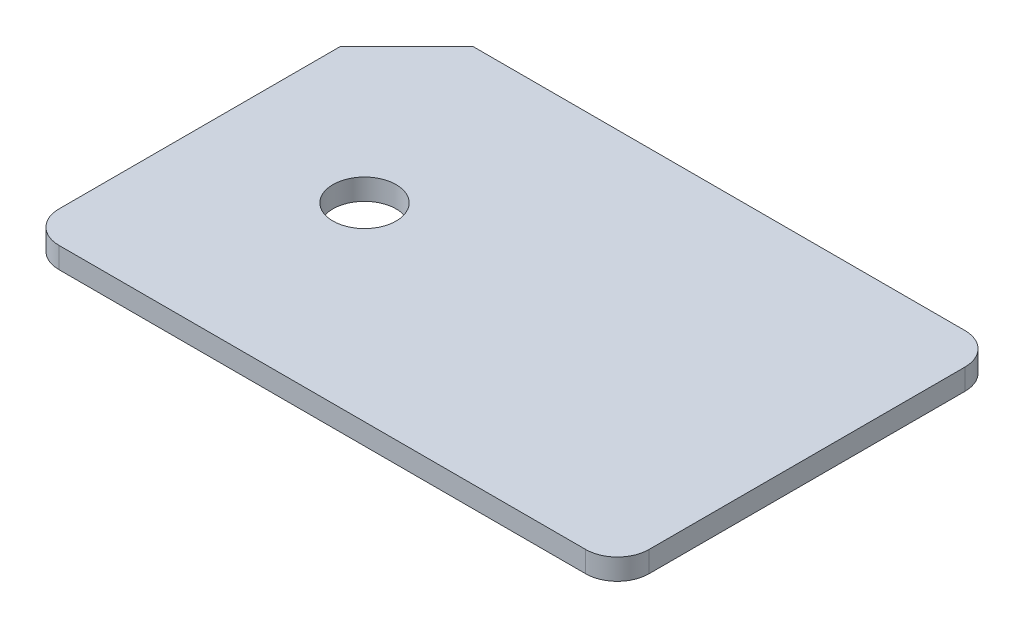
ISO-10303-21;
HEADER;
FILE_DESCRIPTION(('STEP AP214'),'2;1');
FILE_NAME('part.step','',(''),(''),'','','');
FILE_SCHEMA(('AUTOMOTIVE_DESIGN { 1 0 10303 214 1 1 1 1 }'));
ENDSEC;
DATA;
#1=APPLICATION_CONTEXT('core data for automotive mechanical design processes');
#2=APPLICATION_PROTOCOL_DEFINITION('international standard','automotive_design',2000,#1);
#3=PRODUCT_CONTEXT('',#1,'mechanical');
#4=PRODUCT('Part','Part','',(#3));
#5=PRODUCT_RELATED_PRODUCT_CATEGORY('part','',(#4));
#6=PRODUCT_DEFINITION_FORMATION('','',#4);
#7=PRODUCT_DEFINITION_CONTEXT('part definition',#1,'design');
#8=PRODUCT_DEFINITION('design','',#6,#7);
#9=PRODUCT_DEFINITION_SHAPE('','',#8);
#10=(LENGTH_UNIT() NAMED_UNIT(*) SI_UNIT(.MILLI.,.METRE.));
#11=(NAMED_UNIT(*) PLANE_ANGLE_UNIT() SI_UNIT($,.RADIAN.));
#12=(NAMED_UNIT(*) SI_UNIT($,.STERADIAN.) SOLID_ANGLE_UNIT());
#13=UNCERTAINTY_MEASURE_WITH_UNIT(LENGTH_MEASURE(1.E-05),#10,'distance_accuracy_value','');
#14=(GEOMETRIC_REPRESENTATION_CONTEXT(3) GLOBAL_UNCERTAINTY_ASSIGNED_CONTEXT((#13)) GLOBAL_UNIT_ASSIGNED_CONTEXT((#10,
#11,#12)) REPRESENTATION_CONTEXT('',''));
#15=CARTESIAN_POINT('',(0.,0.,0.));
#16=DIRECTION('',(0.,0.,1.));
#17=DIRECTION('',(1.,0.,0.));
#18=AXIS2_PLACEMENT_3D('',#15,#16,#17);
#19=CARTESIAN_POINT('',(-56.6627466075891,2.,-2.88460635432216));
#20=DIRECTION('',(1.,0.,0.));
#21=DIRECTION('',(0.,0.,-1.));
#22=AXIS2_PLACEMENT_3D('',#19,#20,#21);
#23=PLANE('',#22);
#24=DIRECTION('',(0.,0.,1.));
#25=VECTOR('',#24,1.);
#26=CARTESIAN_POINT('',(-56.6627466075891,0.,-2.88460635432216));
#27=LINE('',#26,#25);
#28=CARTESIAN_POINT('',(-56.6627466075892,0.,-29.556179229576));
#29=VERTEX_POINT('',#28);
#30=CARTESIAN_POINT('',(-56.6627466075891,0.,-2.88460635432216));
#31=VERTEX_POINT('',#30);
#32=EDGE_CURVE('E129',#29,#31,#27,.T.);
#33=ORIENTED_EDGE('',*,*,#32,.T.);
#34=DIRECTION('',(0.,-1.,0.));
#35=VECTOR('',#34,1.);
#36=CARTESIAN_POINT('',(-56.6627466075891,2.,-2.88460635432216));
#37=LINE('',#36,#35);
#38=CARTESIAN_POINT('',(-56.6627466075891,2.,-2.88460635432216));
#39=VERTEX_POINT('',#38);
#40=EDGE_CURVE('E11',#39,#31,#37,.T.);
#41=ORIENTED_EDGE('',*,*,#40,.F.);
#42=DIRECTION('',(0.,0.,1.));
#43=VECTOR('',#42,1.);
#44=CARTESIAN_POINT('',(-56.6627466075891,2.,-2.88460635432216));
#45=LINE('',#44,#43);
#46=CARTESIAN_POINT('',(-56.6627466075892,2.,-29.556179229576));
#47=VERTEX_POINT('',#46);
#48=EDGE_CURVE('E144',#47,#39,#45,.T.);
#49=ORIENTED_EDGE('',*,*,#48,.F.);
#50=DIRECTION('',(0.,-1.,0.));
#51=VECTOR('',#50,1.);
#52=CARTESIAN_POINT('',(-56.6627466075892,2.,-29.556179229576));
#53=LINE('',#52,#51);
#54=EDGE_CURVE('E125',#47,#29,#53,.T.);
#55=ORIENTED_EDGE('',*,*,#54,.T.);
#56=EDGE_LOOP('',(#33,#41,#49,#55));
#57=FACE_BOUND('',#56,.T.);
#58=ADVANCED_FACE('F33',(#57),#23,.F.);
#59=CARTESIAN_POINT('',(-53.6627466075891,2.,-2.88460635432216));
#60=DIRECTION('',(0.,-1.,0.));
#61=DIRECTION('',(0.,0.,-1.));
#62=AXIS2_PLACEMENT_3D('',#59,#60,#61);
#63=CYLINDRICAL_SURFACE('',#62,2.99999999999999);
#64=CARTESIAN_POINT('',(-53.6627466075891,0.,-2.88460635432216));
#65=DIRECTION('',(0.,1.,0.));
#66=DIRECTION('',(0.,0.,1.));
#67=AXIS2_PLACEMENT_3D('',#64,#65,#66);
#68=CIRCLE('',#67,2.99999999999999);
#69=CARTESIAN_POINT('',(-53.6627466075891,0.,0.115393645677819));
#70=VERTEX_POINT('',#69);
#71=EDGE_CURVE('E132',#31,#70,#68,.T.);
#72=ORIENTED_EDGE('',*,*,#71,.T.);
#73=DIRECTION('',(0.,-1.,0.));
#74=VECTOR('',#73,1.);
#75=CARTESIAN_POINT('',(-53.6627466075891,2.,0.115393645677819));
#76=LINE('',#75,#74);
#77=CARTESIAN_POINT('',(-53.6627466075891,2.,0.115393645677819));
#78=VERTEX_POINT('',#77);
#79=EDGE_CURVE('E41',#78,#70,#76,.T.);
#80=ORIENTED_EDGE('',*,*,#79,.F.);
#81=CARTESIAN_POINT('',(-53.6627466075891,2.,-2.88460635432216));
#82=DIRECTION('',(0.,1.,0.));
#83=DIRECTION('',(0.,0.,1.));
#84=AXIS2_PLACEMENT_3D('',#81,#82,#83);
#85=CIRCLE('',#84,2.99999999999999);
#86=EDGE_CURVE('E92',#39,#78,#85,.T.);
#87=ORIENTED_EDGE('',*,*,#86,.F.);
#88=ORIENTED_EDGE('',*,*,#40,.T.);
#89=EDGE_LOOP('',(#72,#80,#87,#88));
#90=FACE_BOUND('',#89,.T.);
#91=ADVANCED_FACE('F200',(#90),#63,.T.);
#92=CARTESIAN_POINT('',(-3.66274660758915,2.,0.115393645677819));
#93=DIRECTION('',(0.,0.,-1.));
#94=DIRECTION('',(-1.,0.,0.));
#95=AXIS2_PLACEMENT_3D('',#92,#93,#94);
#96=PLANE('',#95);
#97=DIRECTION('',(1.,0.,0.));
#98=VECTOR('',#97,1.);
#99=CARTESIAN_POINT('',(-3.66274660758915,0.,0.115393645677819));
#100=LINE('',#99,#98);
#101=CARTESIAN_POINT('',(-3.66274660758915,0.,0.115393645677813));
#102=VERTEX_POINT('',#101);
#103=EDGE_CURVE('E135',#70,#102,#100,.T.);
#104=ORIENTED_EDGE('',*,*,#103,.T.);
#105=DIRECTION('',(0.,-1.,0.));
#106=VECTOR('',#105,1.);
#107=CARTESIAN_POINT('',(-3.66274660758915,2.,0.115393645677813));
#108=LINE('',#107,#106);
#109=CARTESIAN_POINT('',(-3.66274660758915,2.,0.115393645677813));
#110=VERTEX_POINT('',#109);
#111=EDGE_CURVE('E151',#110,#102,#108,.T.);
#112=ORIENTED_EDGE('',*,*,#111,.F.);
#113=DIRECTION('',(1.,0.,0.));
#114=VECTOR('',#113,1.);
#115=CARTESIAN_POINT('',(-3.66274660758915,2.,0.115393645677819));
#116=LINE('',#115,#114);
#117=EDGE_CURVE('E159',#78,#110,#116,.T.);
#118=ORIENTED_EDGE('',*,*,#117,.F.);
#119=ORIENTED_EDGE('',*,*,#79,.T.);
#120=EDGE_LOOP('',(#104,#112,#118,#119));
#121=FACE_BOUND('',#120,.T.);
#122=ADVANCED_FACE('F157',(#121),#96,.F.);
#123=CARTESIAN_POINT('',(-3.66274660758915,2.,-2.88460635432219));
#124=DIRECTION('',(0.,-1.,0.));
#125=DIRECTION('',(0.,0.,-1.));
#126=AXIS2_PLACEMENT_3D('',#123,#124,#125);
#127=CYLINDRICAL_SURFACE('',#126,3.);
#128=CARTESIAN_POINT('',(-3.66274660758915,0.,-2.88460635432219));
#129=DIRECTION('',(0.,1.,0.));
#130=DIRECTION('',(0.,0.,1.));
#131=AXIS2_PLACEMENT_3D('',#128,#129,#130);
#132=CIRCLE('',#131,3.);
#133=CARTESIAN_POINT('',(-0.662746607589148,0.,-2.88460635432219));
#134=VERTEX_POINT('',#133);
#135=EDGE_CURVE('E137',#102,#134,#132,.T.);
#136=ORIENTED_EDGE('',*,*,#135,.T.);
#137=DIRECTION('',(0.,-1.,0.));
#138=VECTOR('',#137,1.);
#139=CARTESIAN_POINT('',(-0.662746607589148,2.,-2.88460635432219));
#140=LINE('',#139,#138);
#141=CARTESIAN_POINT('',(-0.662746607589148,2.,-2.88460635432219));
#142=VERTEX_POINT('',#141);
#143=EDGE_CURVE('E148',#142,#134,#140,.T.);
#144=ORIENTED_EDGE('',*,*,#143,.F.);
#145=CARTESIAN_POINT('',(-3.66274660758915,2.,-2.88460635432219));
#146=DIRECTION('',(0.,1.,0.));
#147=DIRECTION('',(0.,0.,1.));
#148=AXIS2_PLACEMENT_3D('',#145,#146,#147);
#149=CIRCLE('',#148,3.);
#150=EDGE_CURVE('E171',#110,#142,#149,.T.);
#151=ORIENTED_EDGE('',*,*,#150,.F.);
#152=ORIENTED_EDGE('',*,*,#111,.T.);
#153=EDGE_LOOP('',(#136,#144,#151,#152));
#154=FACE_BOUND('',#153,.T.);
#155=ADVANCED_FACE('F167',(#154),#127,.T.);
#156=CARTESIAN_POINT('',(-0.662746607589252,2.,-32.8846063543222));
#157=DIRECTION('',(-1.,0.,0.));
#158=DIRECTION('',(0.,0.,1.));
#159=AXIS2_PLACEMENT_3D('',#156,#157,#158);
#160=PLANE('',#159);
#161=DIRECTION('',(0.,0.,-1.));
#162=VECTOR('',#161,1.);
#163=CARTESIAN_POINT('',(-0.662746607589252,0.,-32.8846063543222));
#164=LINE('',#163,#162);
#165=CARTESIAN_POINT('',(-0.662746607589254,0.,-32.8846063543222));
#166=VERTEX_POINT('',#165);
#167=EDGE_CURVE('E139',#134,#166,#164,.T.);
#168=ORIENTED_EDGE('',*,*,#167,.T.);
#169=DIRECTION('',(0.,-1.,0.));
#170=VECTOR('',#169,1.);
#171=CARTESIAN_POINT('',(-0.662746607589254,2.,-32.8846063543222));
#172=LINE('',#171,#170);
#173=CARTESIAN_POINT('',(-0.662746607589254,2.,-32.8846063543222));
#174=VERTEX_POINT('',#173);
#175=EDGE_CURVE('E120',#174,#166,#172,.T.);
#176=ORIENTED_EDGE('',*,*,#175,.F.);
#177=DIRECTION('',(0.,0.,-1.));
#178=VECTOR('',#177,1.);
#179=CARTESIAN_POINT('',(-0.662746607589252,2.,-32.8846063543222));
#180=LINE('',#179,#178);
#181=EDGE_CURVE('E111',#142,#174,#180,.T.);
#182=ORIENTED_EDGE('',*,*,#181,.F.);
#183=ORIENTED_EDGE('',*,*,#143,.T.);
#184=EDGE_LOOP('',(#168,#176,#182,#183));
#185=FACE_BOUND('',#184,.T.);
#186=ADVANCED_FACE('F170',(#185),#160,.F.);
#187=CARTESIAN_POINT('',(-3.66274660758926,2.,-32.8846063543222));
#188=DIRECTION('',(0.,-1.,0.));
#189=DIRECTION('',(0.,0.,-1.));
#190=AXIS2_PLACEMENT_3D('',#187,#188,#189);
#191=CYLINDRICAL_SURFACE('',#190,3.);
#192=CARTESIAN_POINT('',(-3.66274660758926,0.,-32.8846063543222));
#193=DIRECTION('',(0.,1.,0.));
#194=DIRECTION('',(0.,0.,1.));
#195=AXIS2_PLACEMENT_3D('',#192,#193,#194);
#196=CIRCLE('',#195,3.);
#197=CARTESIAN_POINT('',(-3.66274660758926,0.,-35.8846063543222));
#198=VERTEX_POINT('',#197);
#199=EDGE_CURVE('E119',#166,#198,#196,.T.);
#200=ORIENTED_EDGE('',*,*,#199,.T.);
#201=DIRECTION('',(0.,-1.,0.));
#202=VECTOR('',#201,1.);
#203=CARTESIAN_POINT('',(-3.66274660758926,2.,-35.8846063543222));
#204=LINE('',#203,#202);
#205=CARTESIAN_POINT('',(-3.66274660758926,2.,-35.8846063543222));
#206=VERTEX_POINT('',#205);
#207=EDGE_CURVE('E116',#206,#198,#204,.T.);
#208=ORIENTED_EDGE('',*,*,#207,.F.);
#209=CARTESIAN_POINT('',(-3.66274660758926,2.,-32.8846063543222));
#210=DIRECTION('',(0.,1.,0.));
#211=DIRECTION('',(0.,0.,1.));
#212=AXIS2_PLACEMENT_3D('',#209,#210,#211);
#213=CIRCLE('',#212,3.);
#214=EDGE_CURVE('E105',#174,#206,#213,.T.);
#215=ORIENTED_EDGE('',*,*,#214,.F.);
#216=ORIENTED_EDGE('',*,*,#175,.T.);
#217=EDGE_LOOP('',(#200,#208,#215,#216));
#218=FACE_BOUND('',#217,.T.);
#219=ADVANCED_FACE('F117',(#218),#191,.T.);
#220=CARTESIAN_POINT('',(-50.3343194828431,2.,-35.8846063543222));
#221=DIRECTION('',(0.,0.,1.));
#222=DIRECTION('',(1.,0.,0.));
#223=AXIS2_PLACEMENT_3D('',#220,#221,#222);
#224=PLANE('',#223);
#225=DIRECTION('',(-1.,0.,0.));
#226=VECTOR('',#225,1.);
#227=CARTESIAN_POINT('',(-50.3343194828431,0.,-35.8846063543222));
#228=LINE('',#227,#226);
#229=CARTESIAN_POINT('',(-50.3343194828431,0.,-35.8846063543222));
#230=VERTEX_POINT('',#229);
#231=EDGE_CURVE('E78',#198,#230,#228,.T.);
#232=ORIENTED_EDGE('',*,*,#231,.T.);
#233=DIRECTION('',(0.,-1.,0.));
#234=VECTOR('',#233,1.);
#235=CARTESIAN_POINT('',(-50.3343194828431,2.,-35.8846063543222));
#236=LINE('',#235,#234);
#237=CARTESIAN_POINT('',(-50.3343194828431,2.,-35.8846063543222));
#238=VERTEX_POINT('',#237);
#239=EDGE_CURVE('E121',#238,#230,#236,.T.);
#240=ORIENTED_EDGE('',*,*,#239,.F.);
#241=DIRECTION('',(-1.,0.,0.));
#242=VECTOR('',#241,1.);
#243=CARTESIAN_POINT('',(-50.3343194828431,2.,-35.8846063543222));
#244=LINE('',#243,#242);
#245=EDGE_CURVE('E109',#206,#238,#244,.T.);
#246=ORIENTED_EDGE('',*,*,#245,.F.);
#247=ORIENTED_EDGE('',*,*,#207,.T.);
#248=EDGE_LOOP('',(#232,#240,#246,#247));
#249=FACE_BOUND('',#248,.T.);
#250=ADVANCED_FACE('F123',(#249),#224,.F.);
#251=CARTESIAN_POINT('',(-56.6627466075892,2.,-29.556179229576));
#252=DIRECTION('',(0.707106781186549,0.,0.707106781186546));
#253=DIRECTION('',(0.707106781186546,0.,-0.707106781186549));
#254=AXIS2_PLACEMENT_3D('',#251,#252,#253);
#255=PLANE('',#254);
#256=DIRECTION('',(-0.707106781186546,0.,0.707106781186549));
#257=VECTOR('',#256,1.);
#258=CARTESIAN_POINT('',(-56.6627466075892,0.,-29.556179229576));
#259=LINE('',#258,#257);
#260=EDGE_CURVE('E84',#230,#29,#259,.T.);
#261=ORIENTED_EDGE('',*,*,#260,.T.);
#262=ORIENTED_EDGE('',*,*,#54,.F.);
#263=DIRECTION('',(-0.707106781186546,0.,0.707106781186549));
#264=VECTOR('',#263,1.);
#265=CARTESIAN_POINT('',(-56.6627466075892,2.,-29.556179229576));
#266=LINE('',#265,#264);
#267=EDGE_CURVE('E49',#238,#47,#266,.T.);
#268=ORIENTED_EDGE('',*,*,#267,.F.);
#269=ORIENTED_EDGE('',*,*,#239,.T.);
#270=EDGE_LOOP('',(#261,#262,#268,#269));
#271=FACE_BOUND('',#270,.T.);
#272=ADVANCED_FACE('F191',(#271),#255,.F.);
#273=CARTESIAN_POINT('',(-3.66274660758926,2.,-32.8846063543222));
#274=DIRECTION('',(0.,1.,0.));
#275=DIRECTION('',(0.,0.,1.));
#276=AXIS2_PLACEMENT_3D('',#273,#274,#275);
#277=PLANE('',#276);
#278=CARTESIAN_POINT('',(-42.6627466075892,2.,-17.8846063543222));
#279=DIRECTION('',(0.,1.,0.));
#280=DIRECTION('',(0.,0.,1.));
#281=AXIS2_PLACEMENT_3D('',#278,#279,#280);
#282=CIRCLE('',#281,2.99959014728362);
#283=CARTESIAN_POINT('',(-42.6627466075892,2.,-14.8850162070386));
#284=VERTEX_POINT('',#283);
#285=EDGE_CURVE('E177',#284,#284,#282,.T.);
#286=ORIENTED_EDGE('',*,*,#285,.F.);
#287=EDGE_LOOP('',(#286));
#288=FACE_BOUND('',#287,.T.);
#289=ORIENTED_EDGE('',*,*,#48,.T.);
#290=ORIENTED_EDGE('',*,*,#86,.T.);
#291=ORIENTED_EDGE('',*,*,#117,.T.);
#292=ORIENTED_EDGE('',*,*,#150,.T.);
#293=ORIENTED_EDGE('',*,*,#181,.T.);
#294=ORIENTED_EDGE('',*,*,#214,.T.);
#295=ORIENTED_EDGE('',*,*,#245,.T.);
#296=ORIENTED_EDGE('',*,*,#267,.T.);
#297=EDGE_LOOP('',(#289,#290,#291,#292,#293,#294,#295,#296));
#298=FACE_BOUND('',#297,.T.);
#299=ADVANCED_FACE('F107',(#288,#298),#277,.T.);
#300=CARTESIAN_POINT('',(-3.66274660758926,0.,-32.8846063543222));
#301=DIRECTION('',(0.,1.,0.));
#302=DIRECTION('',(0.,0.,1.));
#303=AXIS2_PLACEMENT_3D('',#300,#301,#302);
#304=PLANE('',#303);
#305=CARTESIAN_POINT('',(-42.6627466075892,0.,-17.8846063543222));
#306=DIRECTION('',(0.,1.,0.));
#307=DIRECTION('',(0.,0.,1.));
#308=AXIS2_PLACEMENT_3D('',#305,#306,#307);
#309=CIRCLE('',#308,2.99959014728362);
#310=CARTESIAN_POINT('',(-42.6627466075892,0.,-14.8850162070386));
#311=VERTEX_POINT('',#310);
#312=EDGE_CURVE('E133',#311,#311,#309,.T.);
#313=ORIENTED_EDGE('',*,*,#312,.T.);
#314=EDGE_LOOP('',(#313));
#315=FACE_BOUND('',#314,.T.);
#316=ORIENTED_EDGE('',*,*,#32,.F.);
#317=ORIENTED_EDGE('',*,*,#260,.F.);
#318=ORIENTED_EDGE('',*,*,#231,.F.);
#319=ORIENTED_EDGE('',*,*,#199,.F.);
#320=ORIENTED_EDGE('',*,*,#167,.F.);
#321=ORIENTED_EDGE('',*,*,#135,.F.);
#322=ORIENTED_EDGE('',*,*,#103,.F.);
#323=ORIENTED_EDGE('',*,*,#71,.F.);
#324=EDGE_LOOP('',(#316,#317,#318,#319,#320,#321,#322,#323));
#325=FACE_BOUND('',#324,.T.);
#326=ADVANCED_FACE('F163',(#315,#325),#304,.F.);
#327=CARTESIAN_POINT('',(-42.6627466075892,0.,-17.8846063543222));
#328=DIRECTION('',(0.,1.,0.));
#329=DIRECTION('',(0.,0.,1.));
#330=AXIS2_PLACEMENT_3D('',#327,#328,#329);
#331=CYLINDRICAL_SURFACE('',#330,2.99959014728362);
#332=ORIENTED_EDGE('',*,*,#312,.F.);
#333=EDGE_LOOP('',(#332));
#334=FACE_BOUND('',#333,.T.);
#335=ORIENTED_EDGE('',*,*,#285,.T.);
#336=EDGE_LOOP('',(#335));
#337=FACE_BOUND('',#336,.T.);
#338=ADVANCED_FACE('F184',(#334,#337),#331,.F.);
#339=CLOSED_SHELL('',(#58,#91,#122,#155,#186,#219,#250,#272,#299,#326,#338));
#340=MANIFOLD_SOLID_BREP('B2',#339);
#341=ADVANCED_BREP_SHAPE_REPRESENTATION('',(#18,#340),#14);
#342=SHAPE_DEFINITION_REPRESENTATION(#9,#341);
ENDSEC;
END-ISO-10303-21;
